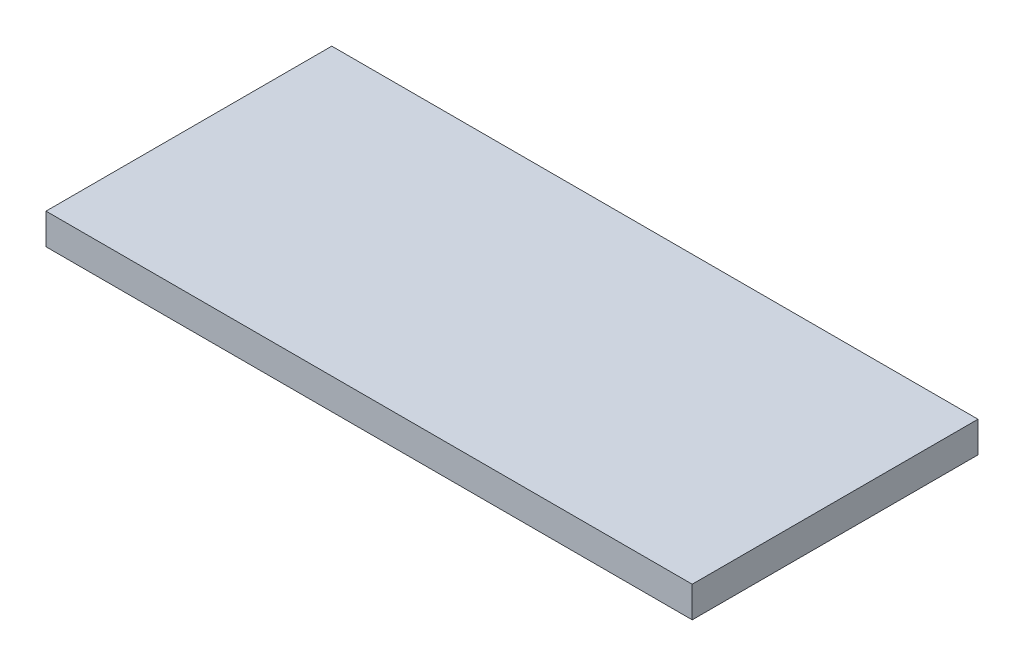
ISO-10303-21;
HEADER;
FILE_DESCRIPTION(('STEP AP214'),'2;1');
FILE_NAME('part.step','',(''),(''),'','','');
FILE_SCHEMA(('AUTOMOTIVE_DESIGN { 1 0 10303 214 1 1 1 1 }'));
ENDSEC;
DATA;
#1=APPLICATION_CONTEXT('core data for automotive mechanical design processes');
#2=APPLICATION_PROTOCOL_DEFINITION('international standard','automotive_design',2000,#1);
#3=PRODUCT_CONTEXT('',#1,'mechanical');
#4=PRODUCT('Part','Part','',(#3));
#5=PRODUCT_RELATED_PRODUCT_CATEGORY('part','',(#4));
#6=PRODUCT_DEFINITION_FORMATION('','',#4);
#7=PRODUCT_DEFINITION_CONTEXT('part definition',#1,'design');
#8=PRODUCT_DEFINITION('design','',#6,#7);
#9=PRODUCT_DEFINITION_SHAPE('','',#8);
#10=(LENGTH_UNIT() NAMED_UNIT(*) SI_UNIT(.MILLI.,.METRE.));
#11=(NAMED_UNIT(*) PLANE_ANGLE_UNIT() SI_UNIT($,.RADIAN.));
#12=(NAMED_UNIT(*) SI_UNIT($,.STERADIAN.) SOLID_ANGLE_UNIT());
#13=UNCERTAINTY_MEASURE_WITH_UNIT(LENGTH_MEASURE(1.E-05),#10,'distance_accuracy_value','');
#14=(GEOMETRIC_REPRESENTATION_CONTEXT(3) GLOBAL_UNCERTAINTY_ASSIGNED_CONTEXT((#13)) GLOBAL_UNIT_ASSIGNED_CONTEXT((#10,
#11,#12)) REPRESENTATION_CONTEXT('',''));
#15=CARTESIAN_POINT('',(0.,0.,0.));
#16=DIRECTION('',(0.,0.,1.));
#17=DIRECTION('',(1.,0.,0.));
#18=AXIS2_PLACEMENT_3D('',#15,#16,#17);
#19=CARTESIAN_POINT('',(62.75,6.,-27.75));
#20=DIRECTION('',(-1.,0.,0.));
#21=DIRECTION('',(0.,0.,1.));
#22=AXIS2_PLACEMENT_3D('',#19,#20,#21);
#23=PLANE('',#22);
#24=DIRECTION('',(0.,0.,-1.));
#25=VECTOR('',#24,1.);
#26=CARTESIAN_POINT('',(62.75,0.,-27.75));
#27=LINE('',#26,#25);
#28=CARTESIAN_POINT('',(62.75,0.,27.75));
#29=VERTEX_POINT('',#28);
#30=CARTESIAN_POINT('',(62.75,0.,-27.75));
#31=VERTEX_POINT('',#30);
#32=EDGE_CURVE('E96',#29,#31,#27,.T.);
#33=ORIENTED_EDGE('',*,*,#32,.T.);
#34=DIRECTION('',(0.,-1.,0.));
#35=VECTOR('',#34,1.);
#36=CARTESIAN_POINT('',(62.75,6.,-27.75));
#37=LINE('',#36,#35);
#38=CARTESIAN_POINT('',(62.75,6.,-27.75));
#39=VERTEX_POINT('',#38);
#40=EDGE_CURVE('E11',#39,#31,#37,.T.);
#41=ORIENTED_EDGE('',*,*,#40,.F.);
#42=DIRECTION('',(0.,0.,-1.));
#43=VECTOR('',#42,1.);
#44=CARTESIAN_POINT('',(62.75,6.,-27.75));
#45=LINE('',#44,#43);
#46=CARTESIAN_POINT('',(62.75,6.,27.75));
#47=VERTEX_POINT('',#46);
#48=EDGE_CURVE('E84',#47,#39,#45,.T.);
#49=ORIENTED_EDGE('',*,*,#48,.F.);
#50=DIRECTION('',(0.,-1.,0.));
#51=VECTOR('',#50,1.);
#52=CARTESIAN_POINT('',(62.75,6.,27.75));
#53=LINE('',#52,#51);
#54=EDGE_CURVE('E92',#47,#29,#53,.T.);
#55=ORIENTED_EDGE('',*,*,#54,.T.);
#56=EDGE_LOOP('',(#33,#41,#49,#55));
#57=FACE_BOUND('',#56,.T.);
#58=ADVANCED_FACE('F33',(#57),#23,.F.);
#59=CARTESIAN_POINT('',(-62.75,6.,-27.75));
#60=DIRECTION('',(0.,0.,1.));
#61=DIRECTION('',(1.,0.,0.));
#62=AXIS2_PLACEMENT_3D('',#59,#60,#61);
#63=PLANE('',#62);
#64=DIRECTION('',(-1.,0.,0.));
#65=VECTOR('',#64,1.);
#66=CARTESIAN_POINT('',(-62.75,0.,-27.75));
#67=LINE('',#66,#65);
#68=CARTESIAN_POINT('',(-62.75,0.,-27.75));
#69=VERTEX_POINT('',#68);
#70=EDGE_CURVE('E88',#31,#69,#67,.T.);
#71=ORIENTED_EDGE('',*,*,#70,.T.);
#72=DIRECTION('',(0.,-1.,0.));
#73=VECTOR('',#72,1.);
#74=CARTESIAN_POINT('',(-62.75,6.,-27.75));
#75=LINE('',#74,#73);
#76=CARTESIAN_POINT('',(-62.75,6.,-27.75));
#77=VERTEX_POINT('',#76);
#78=EDGE_CURVE('E41',#77,#69,#75,.T.);
#79=ORIENTED_EDGE('',*,*,#78,.F.);
#80=DIRECTION('',(-1.,0.,0.));
#81=VECTOR('',#80,1.);
#82=CARTESIAN_POINT('',(-62.75,6.,-27.75));
#83=LINE('',#82,#81);
#84=EDGE_CURVE('E79',#39,#77,#83,.T.);
#85=ORIENTED_EDGE('',*,*,#84,.F.);
#86=ORIENTED_EDGE('',*,*,#40,.T.);
#87=EDGE_LOOP('',(#71,#79,#85,#86));
#88=FACE_BOUND('',#87,.T.);
#89=ADVANCED_FACE('F87',(#88),#63,.F.);
#90=CARTESIAN_POINT('',(-62.75,6.,-27.75));
#91=DIRECTION('',(1.,0.,0.));
#92=DIRECTION('',(0.,0.,-1.));
#93=AXIS2_PLACEMENT_3D('',#90,#91,#92);
#94=PLANE('',#93);
#95=DIRECTION('',(0.,0.,1.));
#96=VECTOR('',#95,1.);
#97=CARTESIAN_POINT('',(-62.75,0.,-27.75));
#98=LINE('',#97,#96);
#99=CARTESIAN_POINT('',(-62.75,0.,27.75));
#100=VERTEX_POINT('',#99);
#101=EDGE_CURVE('E66',#69,#100,#98,.T.);
#102=ORIENTED_EDGE('',*,*,#101,.T.);
#103=DIRECTION('',(0.,-1.,0.));
#104=VECTOR('',#103,1.);
#105=CARTESIAN_POINT('',(-62.75,6.,27.75));
#106=LINE('',#105,#104);
#107=CARTESIAN_POINT('',(-62.75,6.,27.75));
#108=VERTEX_POINT('',#107);
#109=EDGE_CURVE('E89',#108,#100,#106,.T.);
#110=ORIENTED_EDGE('',*,*,#109,.F.);
#111=DIRECTION('',(0.,0.,1.));
#112=VECTOR('',#111,1.);
#113=CARTESIAN_POINT('',(-62.75,6.,-27.75));
#114=LINE('',#113,#112);
#115=EDGE_CURVE('E82',#77,#108,#114,.T.);
#116=ORIENTED_EDGE('',*,*,#115,.F.);
#117=ORIENTED_EDGE('',*,*,#78,.T.);
#118=EDGE_LOOP('',(#102,#110,#116,#117));
#119=FACE_BOUND('',#118,.T.);
#120=ADVANCED_FACE('F90',(#119),#94,.F.);
#121=CARTESIAN_POINT('',(-62.75,6.,27.75));
#122=DIRECTION('',(0.,0.,-1.));
#123=DIRECTION('',(-1.,0.,0.));
#124=AXIS2_PLACEMENT_3D('',#121,#122,#123);
#125=PLANE('',#124);
#126=DIRECTION('',(1.,0.,0.));
#127=VECTOR('',#126,1.);
#128=CARTESIAN_POINT('',(-62.75,0.,27.75));
#129=LINE('',#128,#127);
#130=EDGE_CURVE('E72',#100,#29,#129,.T.);
#131=ORIENTED_EDGE('',*,*,#130,.T.);
#132=ORIENTED_EDGE('',*,*,#54,.F.);
#133=DIRECTION('',(1.,0.,0.));
#134=VECTOR('',#133,1.);
#135=CARTESIAN_POINT('',(-62.75,6.,27.75));
#136=LINE('',#135,#134);
#137=EDGE_CURVE('E49',#108,#47,#136,.T.);
#138=ORIENTED_EDGE('',*,*,#137,.F.);
#139=ORIENTED_EDGE('',*,*,#109,.T.);
#140=EDGE_LOOP('',(#131,#132,#138,#139));
#141=FACE_BOUND('',#140,.T.);
#142=ADVANCED_FACE('F103',(#141),#125,.F.);
#143=CARTESIAN_POINT('',(0.,6.,0.));
#144=DIRECTION('',(0.,1.,0.));
#145=DIRECTION('',(0.,0.,1.));
#146=AXIS2_PLACEMENT_3D('',#143,#144,#145);
#147=PLANE('',#146);
#148=ORIENTED_EDGE('',*,*,#48,.T.);
#149=ORIENTED_EDGE('',*,*,#84,.T.);
#150=ORIENTED_EDGE('',*,*,#115,.T.);
#151=ORIENTED_EDGE('',*,*,#137,.T.);
#152=EDGE_LOOP('',(#148,#149,#150,#151));
#153=FACE_BOUND('',#152,.T.);
#154=ADVANCED_FACE('F80',(#153),#147,.T.);
#155=CARTESIAN_POINT('',(0.,0.,0.));
#156=DIRECTION('',(0.,1.,0.));
#157=DIRECTION('',(0.,0.,1.));
#158=AXIS2_PLACEMENT_3D('',#155,#156,#157);
#159=PLANE('',#158);
#160=ORIENTED_EDGE('',*,*,#32,.F.);
#161=ORIENTED_EDGE('',*,*,#130,.F.);
#162=ORIENTED_EDGE('',*,*,#101,.F.);
#163=ORIENTED_EDGE('',*,*,#70,.F.);
#164=EDGE_LOOP('',(#160,#161,#162,#163));
#165=FACE_BOUND('',#164,.T.);
#166=ADVANCED_FACE('F106',(#165),#159,.F.);
#167=CLOSED_SHELL('',(#58,#89,#120,#142,#154,#166));
#168=MANIFOLD_SOLID_BREP('B2',#167);
#169=ADVANCED_BREP_SHAPE_REPRESENTATION('',(#18,#168),#14);
#170=SHAPE_DEFINITION_REPRESENTATION(#9,#169);
ENDSEC;
END-ISO-10303-21;
